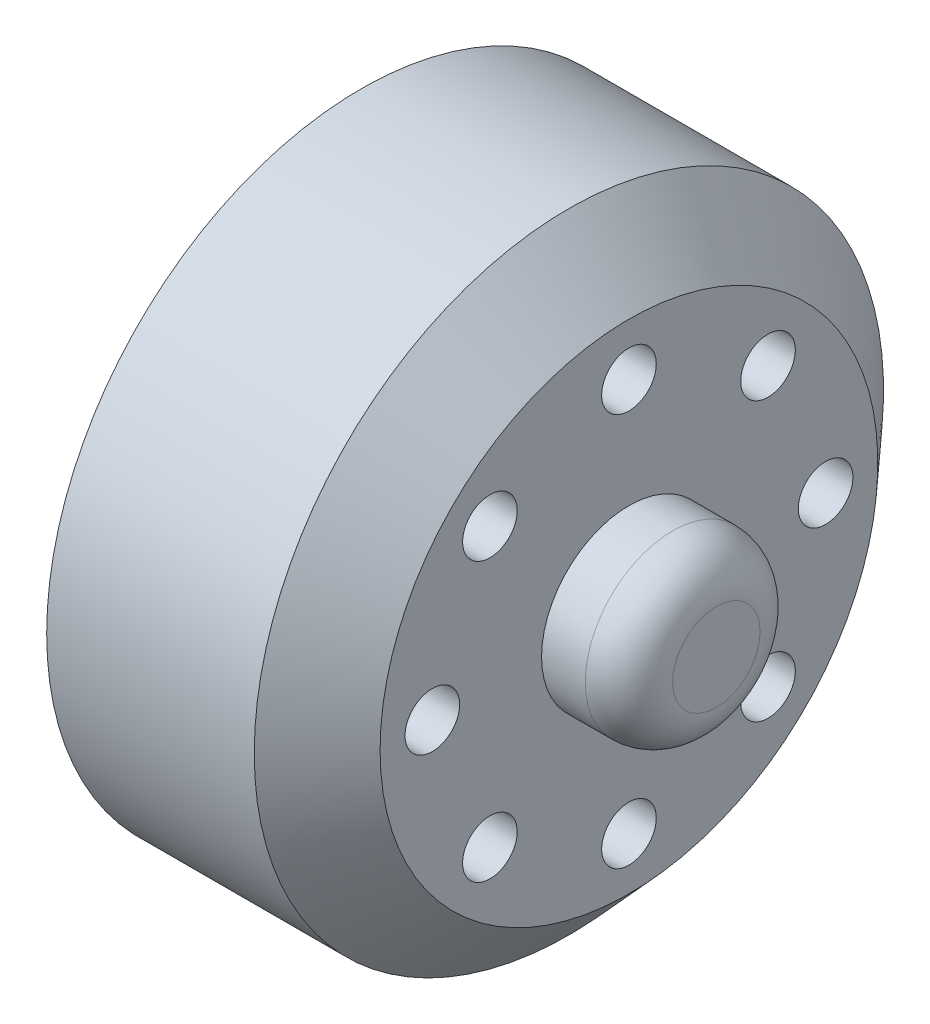
ISO-10303-21;
HEADER;
FILE_DESCRIPTION(('STEP AP214'),'2;1');
FILE_NAME('part.step','',(''),(''),'','','');
FILE_SCHEMA(('AUTOMOTIVE_DESIGN { 1 0 10303 214 1 1 1 1 }'));
ENDSEC;
DATA;
#1=APPLICATION_CONTEXT('core data for automotive mechanical design processes');
#2=APPLICATION_PROTOCOL_DEFINITION('international standard','automotive_design',2000,#1);
#3=PRODUCT_CONTEXT('',#1,'mechanical');
#4=PRODUCT('Part','Part','',(#3));
#5=PRODUCT_RELATED_PRODUCT_CATEGORY('part','',(#4));
#6=PRODUCT_DEFINITION_FORMATION('','',#4);
#7=PRODUCT_DEFINITION_CONTEXT('part definition',#1,'design');
#8=PRODUCT_DEFINITION('design','',#6,#7);
#9=PRODUCT_DEFINITION_SHAPE('','',#8);
#10=(LENGTH_UNIT() NAMED_UNIT(*) SI_UNIT(.MILLI.,.METRE.));
#11=(NAMED_UNIT(*) PLANE_ANGLE_UNIT() SI_UNIT($,.RADIAN.));
#12=(NAMED_UNIT(*) SI_UNIT($,.STERADIAN.) SOLID_ANGLE_UNIT());
#13=UNCERTAINTY_MEASURE_WITH_UNIT(LENGTH_MEASURE(1.E-05),#10,'distance_accuracy_value','');
#14=(GEOMETRIC_REPRESENTATION_CONTEXT(3) GLOBAL_UNCERTAINTY_ASSIGNED_CONTEXT((#13)) GLOBAL_UNIT_ASSIGNED_CONTEXT((#10,
#11,#12)) REPRESENTATION_CONTEXT('',''));
#15=CARTESIAN_POINT('',(0.,0.,0.));
#16=DIRECTION('',(0.,0.,1.));
#17=DIRECTION('',(1.,0.,0.));
#18=AXIS2_PLACEMENT_3D('',#15,#16,#17);
#19=CARTESIAN_POINT('',(-5.16596868854574,6.36396103067838,6.3639610306787));
#20=DIRECTION('',(1.,0.,0.));
#21=DIRECTION('',(0.,0.,-1.));
#22=AXIS2_PLACEMENT_3D('',#19,#20,#21);
#23=CYLINDRICAL_SURFACE('',#22,1.25000000000048);
#24=CARTESIAN_POINT('',(10.6195652173913,6.36396103067838,6.3639610306787));
#25=DIRECTION('',(1.,0.,0.));
#26=DIRECTION('',(0.,0.,-1.));
#27=AXIS2_PLACEMENT_3D('',#24,#25,#26);
#28=CIRCLE('',#27,1.25000000000048);
#29=CARTESIAN_POINT('',(10.6195652173913,6.36396103067838,5.11396103067823));
#30=VERTEX_POINT('',#29);
#31=EDGE_CURVE('E77',#30,#30,#28,.T.);
#32=ORIENTED_EDGE('',*,*,#31,.T.);
#33=EDGE_LOOP('',(#32));
#34=FACE_BOUND('',#33,.T.);
#35=CARTESIAN_POINT('',(5.61956521739131,6.36396103067838,6.3639610306787));
#36=DIRECTION('',(-1.,0.,0.));
#37=DIRECTION('',(0.,0.,1.));
#38=AXIS2_PLACEMENT_3D('',#35,#36,#37);
#39=CIRCLE('',#38,1.25000000000048);
#40=CARTESIAN_POINT('',(5.61956521739131,6.36396103067838,7.61396103067918));
#41=VERTEX_POINT('',#40);
#42=EDGE_CURVE('E41',#41,#41,#39,.F.);
#43=ORIENTED_EDGE('',*,*,#42,.F.);
#44=EDGE_LOOP('',(#43));
#45=FACE_BOUND('',#44,.T.);
#46=ADVANCED_FACE('F37',(#34,#45),#23,.F.);
#47=CARTESIAN_POINT('',(-5.16596868854574,-7.66835063561292E-13,8.99999999999923));
#48=DIRECTION('',(1.,0.,0.));
#49=DIRECTION('',(0.,0.,-1.));
#50=AXIS2_PLACEMENT_3D('',#47,#48,#49);
#51=CYLINDRICAL_SURFACE('',#50,1.25000000000105);
#52=CARTESIAN_POINT('',(10.6195652173913,-7.66835063561292E-13,8.99999999999923));
#53=DIRECTION('',(1.,0.,0.));
#54=DIRECTION('',(0.,0.,-1.));
#55=AXIS2_PLACEMENT_3D('',#52,#53,#54);
#56=CIRCLE('',#55,1.25000000000105);
#57=CARTESIAN_POINT('',(10.6195652173913,-7.66835063561292E-13,7.74999999999819));
#58=VERTEX_POINT('',#57);
#59=EDGE_CURVE('E81',#58,#58,#56,.T.);
#60=ORIENTED_EDGE('',*,*,#59,.T.);
#61=EDGE_LOOP('',(#60));
#62=FACE_BOUND('',#61,.T.);
#63=CARTESIAN_POINT('',(5.61956521739131,-7.66835063561292E-13,8.99999999999923));
#64=DIRECTION('',(-1.,0.,0.));
#65=DIRECTION('',(0.,0.,1.));
#66=AXIS2_PLACEMENT_3D('',#63,#64,#65);
#67=CIRCLE('',#66,1.25000000000105);
#68=CARTESIAN_POINT('',(5.61956521739131,-7.66835063561292E-13,10.2500000000003));
#69=VERTEX_POINT('',#68);
#70=EDGE_CURVE('E72',#69,#69,#67,.F.);
#71=ORIENTED_EDGE('',*,*,#70,.F.);
#72=EDGE_LOOP('',(#71));
#73=FACE_BOUND('',#72,.T.);
#74=ADVANCED_FACE('F140',(#62,#73),#51,.F.);
#75=CARTESIAN_POINT('',(-5.16596868854574,-6.36396103067947,6.36396103067762));
#76=DIRECTION('',(1.,0.,0.));
#77=DIRECTION('',(0.,0.,-1.));
#78=AXIS2_PLACEMENT_3D('',#75,#76,#77);
#79=CYLINDRICAL_SURFACE('',#78,1.25000000000148);
#80=CARTESIAN_POINT('',(10.6195652173913,-6.36396103067947,6.36396103067762));
#81=DIRECTION('',(1.,0.,0.));
#82=DIRECTION('',(0.,0.,-1.));
#83=AXIS2_PLACEMENT_3D('',#80,#81,#82);
#84=CIRCLE('',#83,1.25000000000148);
#85=CARTESIAN_POINT('',(10.6195652173913,-6.36396103067947,5.11396103067614));
#86=VERTEX_POINT('',#85);
#87=EDGE_CURVE('E86',#86,#86,#84,.T.);
#88=ORIENTED_EDGE('',*,*,#87,.T.);
#89=EDGE_LOOP('',(#88));
#90=FACE_BOUND('',#89,.T.);
#91=CARTESIAN_POINT('',(5.61956521739131,-6.36396103067947,6.36396103067762));
#92=DIRECTION('',(-1.,0.,0.));
#93=DIRECTION('',(0.,0.,1.));
#94=AXIS2_PLACEMENT_3D('',#91,#92,#93);
#95=CIRCLE('',#94,1.25000000000148);
#96=CARTESIAN_POINT('',(5.61956521739131,-6.36396103067947,7.6139610306791));
#97=VERTEX_POINT('',#96);
#98=EDGE_CURVE('E70',#97,#97,#95,.F.);
#99=ORIENTED_EDGE('',*,*,#98,.F.);
#100=EDGE_LOOP('',(#99));
#101=FACE_BOUND('',#100,.T.);
#102=ADVANCED_FACE('F145',(#90,#101),#79,.F.);
#103=CARTESIAN_POINT('',(-5.16596868854574,-9.,-1.53146576288412E-12));
#104=DIRECTION('',(1.,0.,0.));
#105=DIRECTION('',(0.,0.,-1.));
#106=AXIS2_PLACEMENT_3D('',#103,#104,#105);
#107=CYLINDRICAL_SURFACE('',#106,1.25000000000152);
#108=CARTESIAN_POINT('',(10.6195652173913,-9.,-1.53146576288412E-12));
#109=DIRECTION('',(1.,0.,0.));
#110=DIRECTION('',(0.,0.,-1.));
#111=AXIS2_PLACEMENT_3D('',#108,#109,#110);
#112=CIRCLE('',#111,1.25000000000152);
#113=CARTESIAN_POINT('',(10.6195652173913,-9.,-1.25000000000306));
#114=VERTEX_POINT('',#113);
#115=EDGE_CURVE('E225',#114,#114,#112,.T.);
#116=ORIENTED_EDGE('',*,*,#115,.T.);
#117=EDGE_LOOP('',(#116));
#118=FACE_BOUND('',#117,.T.);
#119=CARTESIAN_POINT('',(5.61956521739131,-9.,-1.53146576288412E-12));
#120=DIRECTION('',(-1.,0.,0.));
#121=DIRECTION('',(0.,0.,1.));
#122=AXIS2_PLACEMENT_3D('',#119,#120,#121);
#123=CIRCLE('',#122,1.25000000000152);
#124=CARTESIAN_POINT('',(5.61956521739131,-9.,1.24999999999999));
#125=VERTEX_POINT('',#124);
#126=EDGE_CURVE('E67',#125,#125,#123,.F.);
#127=ORIENTED_EDGE('',*,*,#126,.F.);
#128=EDGE_LOOP('',(#127));
#129=FACE_BOUND('',#128,.T.);
#130=ADVANCED_FACE('F237',(#118,#129),#107,.F.);
#131=CARTESIAN_POINT('',(-5.16596868854574,-6.36396103067839,-6.36396103068023));
#132=DIRECTION('',(1.,0.,0.));
#133=DIRECTION('',(0.,0.,-1.));
#134=AXIS2_PLACEMENT_3D('',#131,#132,#133);
#135=CYLINDRICAL_SURFACE('',#134,1.25000000000114);
#136=CARTESIAN_POINT('',(10.6195652173913,-6.36396103067839,-6.36396103068023));
#137=DIRECTION('',(1.,0.,0.));
#138=DIRECTION('',(0.,0.,-1.));
#139=AXIS2_PLACEMENT_3D('',#136,#137,#138);
#140=CIRCLE('',#139,1.25000000000114);
#141=CARTESIAN_POINT('',(10.6195652173913,-6.36396103067839,-7.61396103068137));
#142=VERTEX_POINT('',#141);
#143=EDGE_CURVE('E222',#142,#142,#140,.T.);
#144=ORIENTED_EDGE('',*,*,#143,.T.);
#145=EDGE_LOOP('',(#144));
#146=FACE_BOUND('',#145,.T.);
#147=CARTESIAN_POINT('',(5.61956521739131,-6.36396103067839,-6.36396103068023));
#148=DIRECTION('',(-1.,0.,0.));
#149=DIRECTION('',(0.,0.,1.));
#150=AXIS2_PLACEMENT_3D('',#147,#148,#149);
#151=CIRCLE('',#150,1.25000000000114);
#152=CARTESIAN_POINT('',(5.61956521739131,-6.36396103067839,-5.1139610306791));
#153=VERTEX_POINT('',#152);
#154=EDGE_CURVE('E64',#153,#153,#151,.F.);
#155=ORIENTED_EDGE('',*,*,#154,.F.);
#156=EDGE_LOOP('',(#155));
#157=FACE_BOUND('',#156,.T.);
#158=ADVANCED_FACE('F302',(#146,#157),#135,.F.);
#159=CARTESIAN_POINT('',(-5.16596868854574,7.65732881442059E-13,-9.00000000000076));
#160=DIRECTION('',(1.,0.,0.));
#161=DIRECTION('',(0.,0.,-1.));
#162=AXIS2_PLACEMENT_3D('',#159,#160,#161);
#163=CYLINDRICAL_SURFACE('',#162,1.25000000000054);
#164=CARTESIAN_POINT('',(10.6195652173913,7.65732881442059E-13,-9.00000000000076));
#165=DIRECTION('',(1.,0.,0.));
#166=DIRECTION('',(0.,0.,-1.));
#167=AXIS2_PLACEMENT_3D('',#164,#165,#166);
#168=CIRCLE('',#167,1.25000000000054);
#169=CARTESIAN_POINT('',(10.6195652173913,7.65732881442059E-13,-10.2500000000013));
#170=VERTEX_POINT('',#169);
#171=EDGE_CURVE('E219',#170,#170,#168,.T.);
#172=ORIENTED_EDGE('',*,*,#171,.T.);
#173=EDGE_LOOP('',(#172));
#174=FACE_BOUND('',#173,.T.);
#175=CARTESIAN_POINT('',(5.61956521739131,7.65732881442059E-13,-9.00000000000076));
#176=DIRECTION('',(-1.,0.,0.));
#177=DIRECTION('',(0.,0.,1.));
#178=AXIS2_PLACEMENT_3D('',#175,#176,#177);
#179=CIRCLE('',#178,1.25000000000054);
#180=CARTESIAN_POINT('',(5.61956521739131,7.65732881442059E-13,-7.75000000000023));
#181=VERTEX_POINT('',#180);
#182=EDGE_CURVE('E61',#181,#181,#179,.F.);
#183=ORIENTED_EDGE('',*,*,#182,.F.);
#184=EDGE_LOOP('',(#183));
#185=FACE_BOUND('',#184,.T.);
#186=ADVANCED_FACE('F298',(#174,#185),#163,.F.);
#187=CARTESIAN_POINT('',(-5.16596868854574,6.36396103067947,-6.36396103067915));
#188=DIRECTION('',(1.,0.,0.));
#189=DIRECTION('',(0.,0.,-1.));
#190=AXIS2_PLACEMENT_3D('',#187,#188,#189);
#191=CYLINDRICAL_SURFACE('',#190,1.25000000000007);
#192=CARTESIAN_POINT('',(10.6195652173913,6.36396103067947,-6.36396103067915));
#193=DIRECTION('',(1.,0.,0.));
#194=DIRECTION('',(0.,0.,-1.));
#195=AXIS2_PLACEMENT_3D('',#192,#193,#194);
#196=CIRCLE('',#195,1.25000000000007);
#197=CARTESIAN_POINT('',(10.6195652173913,6.36396103067947,-7.61396103067922));
#198=VERTEX_POINT('',#197);
#199=EDGE_CURVE('E216',#198,#198,#196,.T.);
#200=ORIENTED_EDGE('',*,*,#199,.T.);
#201=EDGE_LOOP('',(#200));
#202=FACE_BOUND('',#201,.T.);
#203=CARTESIAN_POINT('',(5.61956521739131,6.36396103067947,-6.36396103067915));
#204=DIRECTION('',(-1.,0.,0.));
#205=DIRECTION('',(0.,0.,1.));
#206=AXIS2_PLACEMENT_3D('',#203,#204,#205);
#207=CIRCLE('',#206,1.25000000000007);
#208=CARTESIAN_POINT('',(5.61956521739131,6.36396103067947,-5.11396103067908));
#209=VERTEX_POINT('',#208);
#210=EDGE_CURVE('E57',#209,#209,#207,.F.);
#211=ORIENTED_EDGE('',*,*,#210,.F.);
#212=EDGE_LOOP('',(#211));
#213=FACE_BOUND('',#212,.T.);
#214=ADVANCED_FACE('F169',(#202,#213),#191,.F.);
#215=CARTESIAN_POINT('',(-5.16596868854574,9.,0.));
#216=DIRECTION('',(1.,0.,0.));
#217=DIRECTION('',(0.,0.,-1.));
#218=AXIS2_PLACEMENT_3D('',#215,#216,#217);
#219=CYLINDRICAL_SURFACE('',#218,1.25);
#220=CARTESIAN_POINT('',(10.6195652173913,9.,0.));
#221=DIRECTION('',(1.,0.,0.));
#222=DIRECTION('',(0.,0.,-1.));
#223=AXIS2_PLACEMENT_3D('',#220,#221,#222);
#224=CIRCLE('',#223,1.25);
#225=CARTESIAN_POINT('',(10.6195652173913,9.,-1.25));
#226=VERTEX_POINT('',#225);
#227=EDGE_CURVE('E94',#226,#226,#224,.T.);
#228=ORIENTED_EDGE('',*,*,#227,.T.);
#229=EDGE_LOOP('',(#228));
#230=FACE_BOUND('',#229,.T.);
#231=CARTESIAN_POINT('',(5.61956521739131,9.,0.));
#232=DIRECTION('',(-1.,0.,0.));
#233=DIRECTION('',(0.,0.,1.));
#234=AXIS2_PLACEMENT_3D('',#231,#232,#233);
#235=CIRCLE('',#234,1.25);
#236=CARTESIAN_POINT('',(5.61956521739131,9.,1.25));
#237=VERTEX_POINT('',#236);
#238=EDGE_CURVE('E54',#237,#237,#235,.F.);
#239=ORIENTED_EDGE('',*,*,#238,.F.);
#240=EDGE_LOOP('',(#239));
#241=FACE_BOUND('',#240,.T.);
#242=ADVANCED_FACE('F164',(#230,#241),#219,.F.);
#243=CARTESIAN_POINT('',(-1.63043478260869,0.,-14.4));
#244=DIRECTION('',(1.,0.,0.));
#245=DIRECTION('',(0.,0.,-1.));
#246=AXIS2_PLACEMENT_3D('',#243,#244,#245);
#247=PLANE('',#246);
#248=CARTESIAN_POINT('',(-1.63043478260869,6.36396103067838,-6.3639610306787));
#249=DIRECTION('',(-1.,0.,0.));
#250=DIRECTION('',(0.,0.,1.));
#251=AXIS2_PLACEMENT_3D('',#248,#249,#250);
#252=CIRCLE('',#251,2.50000000000048);
#253=CARTESIAN_POINT('',(-1.63043478260869,6.36396103067838,-3.86396103067823));
#254=VERTEX_POINT('',#253);
#255=EDGE_CURVE('E175',#254,#254,#252,.T.);
#256=ORIENTED_EDGE('',*,*,#255,.F.);
#257=EDGE_LOOP('',(#256));
#258=FACE_BOUND('',#257,.T.);
#259=CARTESIAN_POINT('',(-1.63043478260869,-7.66835063561292E-13,-8.99999999999923));
#260=DIRECTION('',(-1.,0.,0.));
#261=DIRECTION('',(0.,0.,1.));
#262=AXIS2_PLACEMENT_3D('',#259,#260,#261);
#263=CIRCLE('',#262,2.50000000000105);
#264=CARTESIAN_POINT('',(-1.63043478260869,-7.66835063561292E-13,-6.49999999999819));
#265=VERTEX_POINT('',#264);
#266=EDGE_CURVE('E179',#265,#265,#263,.T.);
#267=ORIENTED_EDGE('',*,*,#266,.F.);
#268=EDGE_LOOP('',(#267));
#269=FACE_BOUND('',#268,.T.);
#270=CARTESIAN_POINT('',(-1.63043478260869,-6.36396103067947,-6.36396103067762));
#271=DIRECTION('',(-1.,0.,0.));
#272=DIRECTION('',(0.,0.,1.));
#273=AXIS2_PLACEMENT_3D('',#270,#271,#272);
#274=CIRCLE('',#273,2.50000000000148);
#275=CARTESIAN_POINT('',(-1.63043478260869,-6.36396103067947,-3.86396103067614));
#276=VERTEX_POINT('',#275);
#277=EDGE_CURVE('E183',#276,#276,#274,.T.);
#278=ORIENTED_EDGE('',*,*,#277,.F.);
#279=EDGE_LOOP('',(#278));
#280=FACE_BOUND('',#279,.T.);
#281=CARTESIAN_POINT('',(-1.63043478260869,-9.,1.53146576288412E-12));
#282=DIRECTION('',(-1.,0.,0.));
#283=DIRECTION('',(0.,0.,1.));
#284=AXIS2_PLACEMENT_3D('',#281,#282,#283);
#285=CIRCLE('',#284,2.50000000000153);
#286=CARTESIAN_POINT('',(-1.63043478260869,-9.,2.50000000000306));
#287=VERTEX_POINT('',#286);
#288=EDGE_CURVE('E187',#287,#287,#285,.T.);
#289=ORIENTED_EDGE('',*,*,#288,.F.);
#290=EDGE_LOOP('',(#289));
#291=FACE_BOUND('',#290,.T.);
#292=CARTESIAN_POINT('',(-1.63043478260869,-6.36396103067839,6.36396103068023));
#293=DIRECTION('',(-1.,0.,0.));
#294=DIRECTION('',(0.,0.,1.));
#295=AXIS2_PLACEMENT_3D('',#292,#293,#294);
#296=CIRCLE('',#295,2.50000000000114);
#297=CARTESIAN_POINT('',(-1.63043478260869,-6.36396103067839,8.86396103068137));
#298=VERTEX_POINT('',#297);
#299=EDGE_CURVE('E191',#298,#298,#296,.T.);
#300=ORIENTED_EDGE('',*,*,#299,.F.);
#301=EDGE_LOOP('',(#300));
#302=FACE_BOUND('',#301,.T.);
#303=CARTESIAN_POINT('',(-1.63043478260869,7.65732881442059E-13,9.00000000000076));
#304=DIRECTION('',(-1.,0.,0.));
#305=DIRECTION('',(0.,0.,1.));
#306=AXIS2_PLACEMENT_3D('',#303,#304,#305);
#307=CIRCLE('',#306,2.50000000000054);
#308=CARTESIAN_POINT('',(-1.63043478260869,7.65732881442059E-13,11.5000000000013));
#309=VERTEX_POINT('',#308);
#310=EDGE_CURVE('E195',#309,#309,#307,.T.);
#311=ORIENTED_EDGE('',*,*,#310,.F.);
#312=EDGE_LOOP('',(#311));
#313=FACE_BOUND('',#312,.T.);
#314=CARTESIAN_POINT('',(-1.63043478260869,6.36396103067947,6.36396103067915));
#315=DIRECTION('',(-1.,0.,0.));
#316=DIRECTION('',(0.,0.,1.));
#317=AXIS2_PLACEMENT_3D('',#314,#315,#316);
#318=CIRCLE('',#317,2.50000000000007);
#319=CARTESIAN_POINT('',(-1.63043478260869,6.36396103067947,8.86396103067922));
#320=VERTEX_POINT('',#319);
#321=EDGE_CURVE('E199',#320,#320,#318,.T.);
#322=ORIENTED_EDGE('',*,*,#321,.F.);
#323=EDGE_LOOP('',(#322));
#324=FACE_BOUND('',#323,.T.);
#325=CARTESIAN_POINT('',(-1.63043478260869,9.,0.));
#326=DIRECTION('',(-1.,0.,0.));
#327=DIRECTION('',(0.,0.,1.));
#328=AXIS2_PLACEMENT_3D('',#325,#326,#327);
#329=CIRCLE('',#328,2.5);
#330=CARTESIAN_POINT('',(-1.63043478260869,9.,2.5));
#331=VERTEX_POINT('',#330);
#332=EDGE_CURVE('E202',#331,#331,#329,.T.);
#333=ORIENTED_EDGE('',*,*,#332,.F.);
#334=EDGE_LOOP('',(#333));
#335=FACE_BOUND('',#334,.T.);
#336=CARTESIAN_POINT('',(-1.63043478260869,0.,0.));
#337=DIRECTION('',(-1.,0.,0.));
#338=DIRECTION('',(0.,0.,1.));
#339=AXIS2_PLACEMENT_3D('',#336,#337,#338);
#340=CIRCLE('',#339,5.7);
#341=CARTESIAN_POINT('',(-1.63043478260869,0.,5.7));
#342=VERTEX_POINT('',#341);
#343=EDGE_CURVE('E90',#342,#342,#340,.T.);
#344=ORIENTED_EDGE('',*,*,#343,.F.);
#345=EDGE_LOOP('',(#344));
#346=FACE_BOUND('',#345,.T.);
#347=CARTESIAN_POINT('',(-1.63043478260869,0.,0.));
#348=DIRECTION('',(-1.,0.,0.));
#349=DIRECTION('',(0.,0.,1.));
#350=AXIS2_PLACEMENT_3D('',#347,#348,#349);
#351=CIRCLE('',#350,14.4);
#352=CARTESIAN_POINT('',(-1.63043478260869,0.,14.4));
#353=VERTEX_POINT('',#352);
#354=EDGE_CURVE('E50',#353,#353,#351,.T.);
#355=ORIENTED_EDGE('',*,*,#354,.T.);
#356=EDGE_LOOP('',(#355));
#357=FACE_BOUND('',#356,.T.);
#358=ADVANCED_FACE('F108',(#258,#269,#280,#291,#302,#313,#324,#335,#346,#357),#247,.F.);
#359=CARTESIAN_POINT('',(-12.3913043478261,0.,0.));
#360=DIRECTION('',(-1.,0.,0.));
#361=DIRECTION('',(0.,0.,1.));
#362=AXIS2_PLACEMENT_3D('',#359,#360,#361);
#363=CYLINDRICAL_SURFACE('',#362,14.4);
#364=ORIENTED_EDGE('',*,*,#354,.F.);
#365=EDGE_LOOP('',(#364));
#366=FACE_BOUND('',#365,.T.);
#367=CARTESIAN_POINT('',(7.8695652173913,0.,0.));
#368=DIRECTION('',(-1.,0.,0.));
#369=DIRECTION('',(0.,0.,1.));
#370=AXIS2_PLACEMENT_3D('',#367,#368,#369);
#371=CIRCLE('',#370,14.4);
#372=CARTESIAN_POINT('',(7.8695652173913,0.,14.4));
#373=VERTEX_POINT('',#372);
#374=EDGE_CURVE('E103',#373,#373,#371,.T.);
#375=ORIENTED_EDGE('',*,*,#374,.T.);
#376=EDGE_LOOP('',(#375));
#377=FACE_BOUND('',#376,.T.);
#378=ADVANCED_FACE('F110',(#366,#377),#363,.T.);
#379=CARTESIAN_POINT('',(10.6195652173913,0.,0.));
#380=DIRECTION('',(-1.,0.,0.));
#381=DIRECTION('',(0.,0.,1.));
#382=AXIS2_PLACEMENT_3D('',#379,#380,#381);
#383=CONICAL_SURFACE('',#382,11.3904761178154,0.830427658098904);
#384=ORIENTED_EDGE('',*,*,#374,.F.);
#385=EDGE_LOOP('',(#384));
#386=FACE_BOUND('',#385,.T.);
#387=CARTESIAN_POINT('',(10.6195652173913,0.,0.));
#388=DIRECTION('',(-1.,0.,0.));
#389=DIRECTION('',(0.,0.,1.));
#390=AXIS2_PLACEMENT_3D('',#387,#388,#389);
#391=CIRCLE('',#390,11.3904761178154);
#392=CARTESIAN_POINT('',(10.6195652173913,0.,11.3904761178154));
#393=VERTEX_POINT('',#392);
#394=EDGE_CURVE('E100',#393,#393,#391,.T.);
#395=ORIENTED_EDGE('',*,*,#394,.T.);
#396=EDGE_LOOP('',(#395));
#397=FACE_BOUND('',#396,.T.);
#398=ADVANCED_FACE('F113',(#386,#397),#383,.T.);
#399=CARTESIAN_POINT('',(10.6195652173913,0.,-11.3904761178154));
#400=DIRECTION('',(-1.,0.,0.));
#401=DIRECTION('',(0.,0.,1.));
#402=AXIS2_PLACEMENT_3D('',#399,#400,#401);
#403=PLANE('',#402);
#404=ORIENTED_EDGE('',*,*,#227,.F.);
#405=EDGE_LOOP('',(#404));
#406=FACE_BOUND('',#405,.T.);
#407=ORIENTED_EDGE('',*,*,#199,.F.);
#408=EDGE_LOOP('',(#407));
#409=FACE_BOUND('',#408,.T.);
#410=ORIENTED_EDGE('',*,*,#171,.F.);
#411=EDGE_LOOP('',(#410));
#412=FACE_BOUND('',#411,.T.);
#413=ORIENTED_EDGE('',*,*,#143,.F.);
#414=EDGE_LOOP('',(#413));
#415=FACE_BOUND('',#414,.T.);
#416=ORIENTED_EDGE('',*,*,#115,.F.);
#417=EDGE_LOOP('',(#416));
#418=FACE_BOUND('',#417,.T.);
#419=ORIENTED_EDGE('',*,*,#87,.F.);
#420=EDGE_LOOP('',(#419));
#421=FACE_BOUND('',#420,.T.);
#422=ORIENTED_EDGE('',*,*,#59,.F.);
#423=EDGE_LOOP('',(#422));
#424=FACE_BOUND('',#423,.T.);
#425=ORIENTED_EDGE('',*,*,#31,.F.);
#426=EDGE_LOOP('',(#425));
#427=FACE_BOUND('',#426,.T.);
#428=ORIENTED_EDGE('',*,*,#394,.F.);
#429=EDGE_LOOP('',(#428));
#430=FACE_BOUND('',#429,.T.);
#431=CARTESIAN_POINT('',(10.6195652173913,0.,0.));
#432=DIRECTION('',(-1.,0.,0.));
#433=DIRECTION('',(0.,0.,1.));
#434=AXIS2_PLACEMENT_3D('',#431,#432,#433);
#435=CIRCLE('',#434,4.);
#436=CARTESIAN_POINT('',(10.6195652173913,0.,4.));
#437=VERTEX_POINT('',#436);
#438=EDGE_CURVE('E97',#437,#437,#435,.T.);
#439=ORIENTED_EDGE('',*,*,#438,.T.);
#440=EDGE_LOOP('',(#439));
#441=FACE_BOUND('',#440,.T.);
#442=ADVANCED_FACE('F119',(#406,#409,#412,#415,#418,#421,#424,#427,#430,#441),#403,.F.);
#443=CARTESIAN_POINT('',(-12.3913043478261,0.,0.));
#444=DIRECTION('',(-1.,0.,0.));
#445=DIRECTION('',(0.,0.,1.));
#446=AXIS2_PLACEMENT_3D('',#443,#444,#445);
#447=CYLINDRICAL_SURFACE('',#446,4.);
#448=CARTESIAN_POINT('',(12.6195652173913,0.,0.));
#449=DIRECTION('',(-1.,0.,0.));
#450=DIRECTION('',(0.,0.,1.));
#451=AXIS2_PLACEMENT_3D('',#448,#449,#450);
#452=CIRCLE('',#451,4.);
#453=CARTESIAN_POINT('',(12.6195652173913,0.,4.));
#454=VERTEX_POINT('',#453);
#455=EDGE_CURVE('E45',#454,#454,#452,.T.);
#456=ORIENTED_EDGE('',*,*,#455,.T.);
#457=EDGE_LOOP('',(#456));
#458=FACE_BOUND('',#457,.T.);
#459=ORIENTED_EDGE('',*,*,#438,.F.);
#460=EDGE_LOOP('',(#459));
#461=FACE_BOUND('',#460,.T.);
#462=ADVANCED_FACE('F125',(#458,#461),#447,.T.);
#463=CARTESIAN_POINT('',(14.6195652173913,0.,-4.));
#464=DIRECTION('',(-1.,0.,0.));
#465=DIRECTION('',(0.,0.,1.));
#466=AXIS2_PLACEMENT_3D('',#463,#464,#465);
#467=PLANE('',#466);
#468=CARTESIAN_POINT('',(14.6195652173913,0.,0.));
#469=DIRECTION('',(-1.,0.,0.));
#470=DIRECTION('',(0.,0.,1.));
#471=AXIS2_PLACEMENT_3D('',#468,#469,#470);
#472=CIRCLE('',#471,2.);
#473=CARTESIAN_POINT('',(14.6195652173913,0.,2.));
#474=VERTEX_POINT('',#473);
#475=EDGE_CURVE('E11',#474,#474,#472,.F.);
#476=ORIENTED_EDGE('',*,*,#475,.T.);
#477=EDGE_LOOP('',(#476));
#478=FACE_BOUND('',#477,.T.);
#479=ADVANCED_FACE('F131',(#478),#467,.F.);
#480=CARTESIAN_POINT('',(3.07169239559481,0.,-5.7));
#481=DIRECTION('',(1.,0.,0.));
#482=DIRECTION('',(0.,0.,-1.));
#483=AXIS2_PLACEMENT_3D('',#480,#481,#482);
#484=PLANE('',#483);
#485=CARTESIAN_POINT('',(3.07169239559481,0.,0.));
#486=DIRECTION('',(-1.,0.,0.));
#487=DIRECTION('',(0.,0.,1.));
#488=AXIS2_PLACEMENT_3D('',#485,#486,#487);
#489=CIRCLE('',#488,5.7);
#490=CARTESIAN_POINT('',(3.07169239559481,0.,5.7));
#491=VERTEX_POINT('',#490);
#492=EDGE_CURVE('E93',#491,#491,#489,.T.);
#493=ORIENTED_EDGE('',*,*,#492,.T.);
#494=EDGE_LOOP('',(#493));
#495=FACE_BOUND('',#494,.T.);
#496=ADVANCED_FACE('F137',(#495),#484,.F.);
#497=CARTESIAN_POINT('',(-12.3913043478261,0.,0.));
#498=DIRECTION('',(-1.,0.,0.));
#499=DIRECTION('',(0.,0.,1.));
#500=AXIS2_PLACEMENT_3D('',#497,#498,#499);
#501=CYLINDRICAL_SURFACE('',#500,5.7);
#502=ORIENTED_EDGE('',*,*,#492,.F.);
#503=EDGE_LOOP('',(#502));
#504=FACE_BOUND('',#503,.T.);
#505=ORIENTED_EDGE('',*,*,#343,.T.);
#506=EDGE_LOOP('',(#505));
#507=FACE_BOUND('',#506,.T.);
#508=ADVANCED_FACE('F151',(#504,#507),#501,.F.);
#509=CARTESIAN_POINT('',(12.6195652173913,0.,0.));
#510=DIRECTION('',(-1.,0.,0.));
#511=DIRECTION('',(0.,0.,1.));
#512=AXIS2_PLACEMENT_3D('',#509,#510,#511);
#513=DEGENERATE_TOROIDAL_SURFACE('',#512,2.,2.,.T.);
#514=ORIENTED_EDGE('',*,*,#475,.F.);
#515=EDGE_LOOP('',(#514));
#516=FACE_BOUND('',#515,.T.);
#517=ORIENTED_EDGE('',*,*,#455,.F.);
#518=EDGE_LOOP('',(#517));
#519=FACE_BOUND('',#518,.T.);
#520=ADVANCED_FACE('F39',(#516,#519),#513,.T.);
#521=CARTESIAN_POINT('',(5.61956521739131,0.,-11.3904761178154));
#522=DIRECTION('',(-1.,0.,0.));
#523=DIRECTION('',(0.,0.,1.));
#524=AXIS2_PLACEMENT_3D('',#521,#522,#523);
#525=PLANE('',#524);
#526=CARTESIAN_POINT('',(5.61956521739131,9.,0.));
#527=DIRECTION('',(-1.,0.,0.));
#528=DIRECTION('',(0.,0.,1.));
#529=AXIS2_PLACEMENT_3D('',#526,#527,#528);
#530=CIRCLE('',#529,2.5);
#531=CARTESIAN_POINT('',(5.61956521739131,9.,2.5));
#532=VERTEX_POINT('',#531);
#533=EDGE_CURVE('E58',#532,#532,#530,.F.);
#534=ORIENTED_EDGE('',*,*,#533,.F.);
#535=EDGE_LOOP('',(#534));
#536=FACE_BOUND('',#535,.T.);
#537=ORIENTED_EDGE('',*,*,#238,.T.);
#538=EDGE_LOOP('',(#537));
#539=FACE_BOUND('',#538,.T.);
#540=ADVANCED_FACE('F289',(#536,#539),#525,.T.);
#541=CARTESIAN_POINT('',(17.6906330292611,9.,0.));
#542=DIRECTION('',(-1.,0.,0.));
#543=DIRECTION('',(0.,0.,1.));
#544=AXIS2_PLACEMENT_3D('',#541,#542,#543);
#545=CYLINDRICAL_SURFACE('',#544,2.5);
#546=ORIENTED_EDGE('',*,*,#533,.T.);
#547=EDGE_LOOP('',(#546));
#548=FACE_BOUND('',#547,.T.);
#549=ORIENTED_EDGE('',*,*,#332,.T.);
#550=EDGE_LOOP('',(#549));
#551=FACE_BOUND('',#550,.T.);
#552=ADVANCED_FACE('F284',(#548,#551),#545,.F.);
#553=CARTESIAN_POINT('',(5.61956521739131,0.,-11.3904761178154));
#554=DIRECTION('',(-1.,0.,0.));
#555=DIRECTION('',(0.,0.,1.));
#556=AXIS2_PLACEMENT_3D('',#553,#554,#555);
#557=PLANE('',#556);
#558=CARTESIAN_POINT('',(5.61956521739131,6.36396103067838,-6.3639610306787));
#559=DIRECTION('',(-1.,0.,0.));
#560=DIRECTION('',(0.,0.,1.));
#561=AXIS2_PLACEMENT_3D('',#558,#559,#560);
#562=CIRCLE('',#561,2.50000000000048);
#563=CARTESIAN_POINT('',(5.61956521739131,6.36396103067838,-3.86396103067823));
#564=VERTEX_POINT('',#563);
#565=EDGE_CURVE('E211',#564,#564,#562,.F.);
#566=ORIENTED_EDGE('',*,*,#565,.F.);
#567=EDGE_LOOP('',(#566));
#568=FACE_BOUND('',#567,.T.);
#569=ORIENTED_EDGE('',*,*,#210,.T.);
#570=EDGE_LOOP('',(#569));
#571=FACE_BOUND('',#570,.T.);
#572=ADVANCED_FACE('F281',(#568,#571),#557,.T.);
#573=CARTESIAN_POINT('',(17.6906330292611,6.36396103067838,-6.3639610306787));
#574=DIRECTION('',(-1.,0.,0.));
#575=DIRECTION('',(0.,0.,1.));
#576=AXIS2_PLACEMENT_3D('',#573,#574,#575);
#577=CYLINDRICAL_SURFACE('',#576,2.50000000000048);
#578=ORIENTED_EDGE('',*,*,#565,.T.);
#579=EDGE_LOOP('',(#578));
#580=FACE_BOUND('',#579,.T.);
#581=ORIENTED_EDGE('',*,*,#255,.T.);
#582=EDGE_LOOP('',(#581));
#583=FACE_BOUND('',#582,.T.);
#584=ADVANCED_FACE('F276',(#580,#583),#577,.F.);
#585=CARTESIAN_POINT('',(5.61956521739131,0.,-11.3904761178154));
#586=DIRECTION('',(-1.,0.,0.));
#587=DIRECTION('',(0.,0.,1.));
#588=AXIS2_PLACEMENT_3D('',#585,#586,#587);
#589=PLANE('',#588);
#590=CARTESIAN_POINT('',(5.61956521739131,-7.66835063561292E-13,-8.99999999999923));
#591=DIRECTION('',(-1.,0.,0.));
#592=DIRECTION('',(0.,0.,1.));
#593=AXIS2_PLACEMENT_3D('',#590,#591,#592);
#594=CIRCLE('',#593,2.50000000000105);
#595=CARTESIAN_POINT('',(5.61956521739131,-7.66835063561292E-13,-6.49999999999819));
#596=VERTEX_POINT('',#595);
#597=EDGE_CURVE('E470',#596,#596,#594,.F.);
#598=ORIENTED_EDGE('',*,*,#597,.F.);
#599=EDGE_LOOP('',(#598));
#600=FACE_BOUND('',#599,.T.);
#601=ORIENTED_EDGE('',*,*,#182,.T.);
#602=EDGE_LOOP('',(#601));
#603=FACE_BOUND('',#602,.T.);
#604=ADVANCED_FACE('F273',(#600,#603),#589,.T.);
#605=CARTESIAN_POINT('',(17.6906330292611,-7.66835063561292E-13,-8.99999999999923));
#606=DIRECTION('',(-1.,0.,0.));
#607=DIRECTION('',(0.,0.,1.));
#608=AXIS2_PLACEMENT_3D('',#605,#606,#607);
#609=CYLINDRICAL_SURFACE('',#608,2.50000000000105);
#610=ORIENTED_EDGE('',*,*,#597,.T.);
#611=EDGE_LOOP('',(#610));
#612=FACE_BOUND('',#611,.T.);
#613=ORIENTED_EDGE('',*,*,#266,.T.);
#614=EDGE_LOOP('',(#613));
#615=FACE_BOUND('',#614,.T.);
#616=ADVANCED_FACE('F268',(#612,#615),#609,.F.);
#617=CARTESIAN_POINT('',(5.61956521739131,0.,-11.3904761178154));
#618=DIRECTION('',(-1.,0.,0.));
#619=DIRECTION('',(0.,0.,1.));
#620=AXIS2_PLACEMENT_3D('',#617,#618,#619);
#621=PLANE('',#620);
#622=CARTESIAN_POINT('',(5.61956521739131,-6.36396103067947,-6.36396103067762));
#623=DIRECTION('',(-1.,0.,0.));
#624=DIRECTION('',(0.,0.,1.));
#625=AXIS2_PLACEMENT_3D('',#622,#623,#624);
#626=CIRCLE('',#625,2.50000000000148);
#627=CARTESIAN_POINT('',(5.61956521739131,-6.36396103067947,-3.86396103067614));
#628=VERTEX_POINT('',#627);
#629=EDGE_CURVE('E466',#628,#628,#626,.F.);
#630=ORIENTED_EDGE('',*,*,#629,.F.);
#631=EDGE_LOOP('',(#630));
#632=FACE_BOUND('',#631,.T.);
#633=ORIENTED_EDGE('',*,*,#154,.T.);
#634=EDGE_LOOP('',(#633));
#635=FACE_BOUND('',#634,.T.);
#636=ADVANCED_FACE('F265',(#632,#635),#621,.T.);
#637=CARTESIAN_POINT('',(17.6906330292611,-6.36396103067947,-6.36396103067762));
#638=DIRECTION('',(-1.,0.,0.));
#639=DIRECTION('',(0.,0.,1.));
#640=AXIS2_PLACEMENT_3D('',#637,#638,#639);
#641=CYLINDRICAL_SURFACE('',#640,2.50000000000148);
#642=ORIENTED_EDGE('',*,*,#629,.T.);
#643=EDGE_LOOP('',(#642));
#644=FACE_BOUND('',#643,.T.);
#645=ORIENTED_EDGE('',*,*,#277,.T.);
#646=EDGE_LOOP('',(#645));
#647=FACE_BOUND('',#646,.T.);
#648=ADVANCED_FACE('F262',(#644,#647),#641,.F.);
#649=CARTESIAN_POINT('',(5.61956521739131,0.,-11.3904761178154));
#650=DIRECTION('',(-1.,0.,0.));
#651=DIRECTION('',(0.,0.,1.));
#652=AXIS2_PLACEMENT_3D('',#649,#650,#651);
#653=PLANE('',#652);
#654=CARTESIAN_POINT('',(5.61956521739131,-9.,1.53146576288412E-12));
#655=DIRECTION('',(-1.,0.,0.));
#656=DIRECTION('',(0.,0.,1.));
#657=AXIS2_PLACEMENT_3D('',#654,#655,#656);
#658=CIRCLE('',#657,2.50000000000153);
#659=CARTESIAN_POINT('',(5.61956521739131,-9.,2.50000000000306));
#660=VERTEX_POINT('',#659);
#661=EDGE_CURVE('E462',#660,#660,#658,.F.);
#662=ORIENTED_EDGE('',*,*,#661,.F.);
#663=EDGE_LOOP('',(#662));
#664=FACE_BOUND('',#663,.T.);
#665=ORIENTED_EDGE('',*,*,#126,.T.);
#666=EDGE_LOOP('',(#665));
#667=FACE_BOUND('',#666,.T.);
#668=ADVANCED_FACE('F253',(#664,#667),#653,.T.);
#669=CARTESIAN_POINT('',(17.6906330292611,-9.,1.53146576288412E-12));
#670=DIRECTION('',(-1.,0.,0.));
#671=DIRECTION('',(0.,0.,1.));
#672=AXIS2_PLACEMENT_3D('',#669,#670,#671);
#673=CYLINDRICAL_SURFACE('',#672,2.50000000000153);
#674=ORIENTED_EDGE('',*,*,#661,.T.);
#675=EDGE_LOOP('',(#674));
#676=FACE_BOUND('',#675,.T.);
#677=ORIENTED_EDGE('',*,*,#288,.T.);
#678=EDGE_LOOP('',(#677));
#679=FACE_BOUND('',#678,.T.);
#680=ADVANCED_FACE('F243',(#676,#679),#673,.F.);
#681=CARTESIAN_POINT('',(5.61956521739131,0.,-11.3904761178154));
#682=DIRECTION('',(-1.,0.,0.));
#683=DIRECTION('',(0.,0.,1.));
#684=AXIS2_PLACEMENT_3D('',#681,#682,#683);
#685=PLANE('',#684);
#686=CARTESIAN_POINT('',(5.61956521739131,-6.36396103067839,6.36396103068023));
#687=DIRECTION('',(-1.,0.,0.));
#688=DIRECTION('',(0.,0.,1.));
#689=AXIS2_PLACEMENT_3D('',#686,#687,#688);
#690=CIRCLE('',#689,2.50000000000114);
#691=CARTESIAN_POINT('',(5.61956521739131,-6.36396103067839,8.86396103068137));
#692=VERTEX_POINT('',#691);
#693=EDGE_CURVE('E459',#692,#692,#690,.F.);
#694=ORIENTED_EDGE('',*,*,#693,.F.);
#695=EDGE_LOOP('',(#694));
#696=FACE_BOUND('',#695,.T.);
#697=ORIENTED_EDGE('',*,*,#98,.T.);
#698=EDGE_LOOP('',(#697));
#699=FACE_BOUND('',#698,.T.);
#700=ADVANCED_FACE('F240',(#696,#699),#685,.T.);
#701=CARTESIAN_POINT('',(17.6906330292611,-6.36396103067839,6.36396103068023));
#702=DIRECTION('',(-1.,0.,0.));
#703=DIRECTION('',(0.,0.,1.));
#704=AXIS2_PLACEMENT_3D('',#701,#702,#703);
#705=CYLINDRICAL_SURFACE('',#704,2.50000000000114);
#706=ORIENTED_EDGE('',*,*,#693,.T.);
#707=EDGE_LOOP('',(#706));
#708=FACE_BOUND('',#707,.T.);
#709=ORIENTED_EDGE('',*,*,#299,.T.);
#710=EDGE_LOOP('',(#709));
#711=FACE_BOUND('',#710,.T.);
#712=ADVANCED_FACE('F242',(#708,#711),#705,.F.);
#713=CARTESIAN_POINT('',(5.61956521739131,0.,-11.3904761178154));
#714=DIRECTION('',(-1.,0.,0.));
#715=DIRECTION('',(0.,0.,1.));
#716=AXIS2_PLACEMENT_3D('',#713,#714,#715);
#717=PLANE('',#716);
#718=CARTESIAN_POINT('',(5.61956521739131,7.65732881442059E-13,9.00000000000076));
#719=DIRECTION('',(-1.,0.,0.));
#720=DIRECTION('',(0.,0.,1.));
#721=AXIS2_PLACEMENT_3D('',#718,#719,#720);
#722=CIRCLE('',#721,2.50000000000054);
#723=CARTESIAN_POINT('',(5.61956521739131,7.65732881442059E-13,11.5000000000013));
#724=VERTEX_POINT('',#723);
#725=EDGE_CURVE('E454',#724,#724,#722,.F.);
#726=ORIENTED_EDGE('',*,*,#725,.F.);
#727=EDGE_LOOP('',(#726));
#728=FACE_BOUND('',#727,.T.);
#729=ORIENTED_EDGE('',*,*,#70,.T.);
#730=EDGE_LOOP('',(#729));
#731=FACE_BOUND('',#730,.T.);
#732=ADVANCED_FACE('F250',(#728,#731),#717,.T.);
#733=CARTESIAN_POINT('',(17.6906330292611,7.65732881442059E-13,9.00000000000076));
#734=DIRECTION('',(-1.,0.,0.));
#735=DIRECTION('',(0.,0.,1.));
#736=AXIS2_PLACEMENT_3D('',#733,#734,#735);
#737=CYLINDRICAL_SURFACE('',#736,2.50000000000054);
#738=ORIENTED_EDGE('',*,*,#725,.T.);
#739=EDGE_LOOP('',(#738));
#740=FACE_BOUND('',#739,.T.);
#741=ORIENTED_EDGE('',*,*,#310,.T.);
#742=EDGE_LOOP('',(#741));
#743=FACE_BOUND('',#742,.T.);
#744=ADVANCED_FACE('F258',(#740,#743),#737,.F.);
#745=CARTESIAN_POINT('',(5.61956521739131,0.,-11.3904761178154));
#746=DIRECTION('',(-1.,0.,0.));
#747=DIRECTION('',(0.,0.,1.));
#748=AXIS2_PLACEMENT_3D('',#745,#746,#747);
#749=PLANE('',#748);
#750=CARTESIAN_POINT('',(5.61956521739131,6.36396103067947,6.36396103067915));
#751=DIRECTION('',(-1.,0.,0.));
#752=DIRECTION('',(0.,0.,1.));
#753=AXIS2_PLACEMENT_3D('',#750,#751,#752);
#754=CIRCLE('',#753,2.50000000000007);
#755=CARTESIAN_POINT('',(5.61956521739131,6.36396103067947,8.86396103067922));
#756=VERTEX_POINT('',#755);
#757=EDGE_CURVE('E204',#756,#756,#754,.F.);
#758=ORIENTED_EDGE('',*,*,#757,.F.);
#759=EDGE_LOOP('',(#758));
#760=FACE_BOUND('',#759,.T.);
#761=ORIENTED_EDGE('',*,*,#42,.T.);
#762=EDGE_LOOP('',(#761));
#763=FACE_BOUND('',#762,.T.);
#764=ADVANCED_FACE('F429',(#760,#763),#749,.T.);
#765=CARTESIAN_POINT('',(17.6906330292611,6.36396103067947,6.36396103067915));
#766=DIRECTION('',(-1.,0.,0.));
#767=DIRECTION('',(0.,0.,1.));
#768=AXIS2_PLACEMENT_3D('',#765,#766,#767);
#769=CYLINDRICAL_SURFACE('',#768,2.50000000000007);
#770=ORIENTED_EDGE('',*,*,#757,.T.);
#771=EDGE_LOOP('',(#770));
#772=FACE_BOUND('',#771,.T.);
#773=ORIENTED_EDGE('',*,*,#321,.T.);
#774=EDGE_LOOP('',(#773));
#775=FACE_BOUND('',#774,.T.);
#776=ADVANCED_FACE('F438',(#772,#775),#769,.F.);
#777=CLOSED_SHELL('',(#46,#74,#102,#130,#158,#186,#214,#242,#358,#378,#398,#442,#462,#479,#496,
#508,#520,#540,#552,#572,#584,#604,#616,#636,#648,#668,#680,#700,#712,#732,#744,#764,#776));
#778=MANIFOLD_SOLID_BREP('B2',#777);
#779=ADVANCED_BREP_SHAPE_REPRESENTATION('',(#18,#778),#14);
#780=SHAPE_DEFINITION_REPRESENTATION(#9,#779);
ENDSEC;
END-ISO-10303-21;
